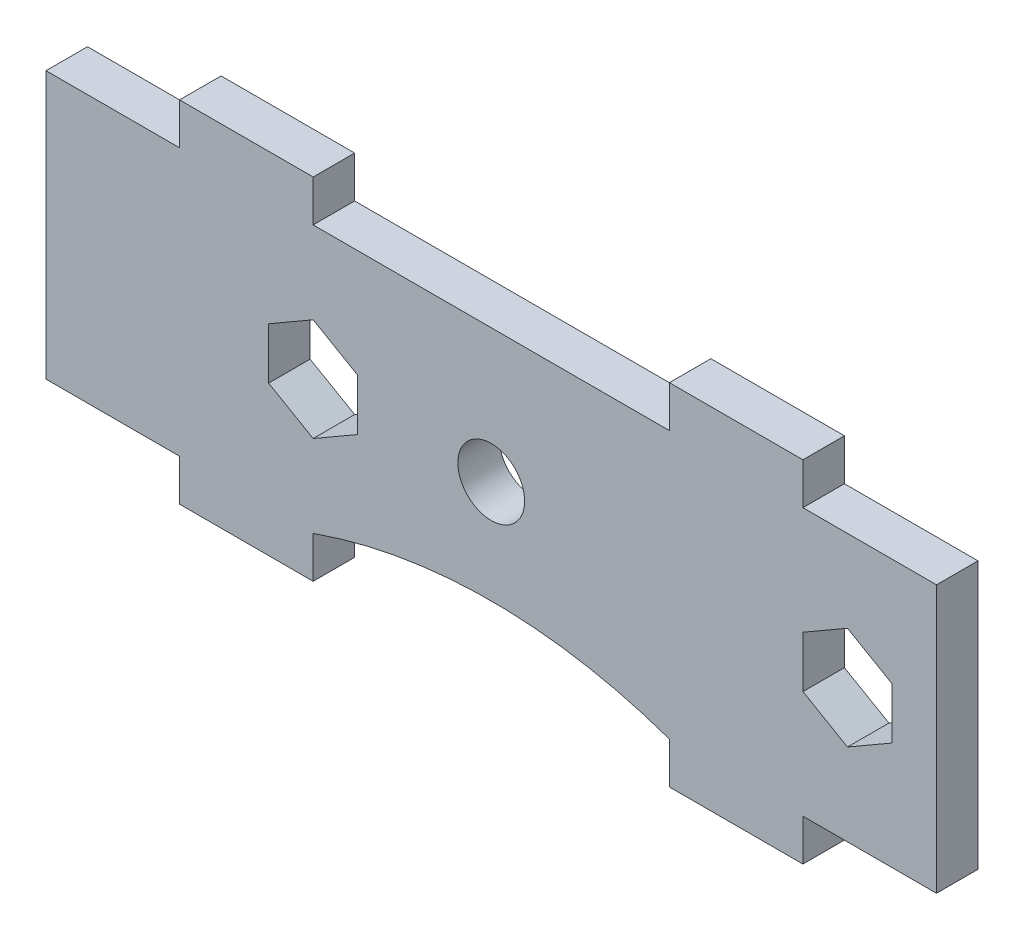
ISO-10303-21;
HEADER;
FILE_DESCRIPTION(('STEP AP214'),'2;1');
FILE_NAME('part.step','',(''),(''),'','','');
FILE_SCHEMA(('AUTOMOTIVE_DESIGN { 1 0 10303 214 1 1 1 1 }'));
ENDSEC;
DATA;
#1=APPLICATION_CONTEXT('core data for automotive mechanical design processes');
#2=APPLICATION_PROTOCOL_DEFINITION('international standard','automotive_design',2000,#1);
#3=PRODUCT_CONTEXT('',#1,'mechanical');
#4=PRODUCT('Part','Part','',(#3));
#5=PRODUCT_RELATED_PRODUCT_CATEGORY('part','',(#4));
#6=PRODUCT_DEFINITION_FORMATION('','',#4);
#7=PRODUCT_DEFINITION_CONTEXT('part definition',#1,'design');
#8=PRODUCT_DEFINITION('design','',#6,#7);
#9=PRODUCT_DEFINITION_SHAPE('','',#8);
#10=(LENGTH_UNIT() NAMED_UNIT(*) SI_UNIT(.MILLI.,.METRE.));
#11=(NAMED_UNIT(*) PLANE_ANGLE_UNIT() SI_UNIT($,.RADIAN.));
#12=(NAMED_UNIT(*) SI_UNIT($,.STERADIAN.) SOLID_ANGLE_UNIT());
#13=UNCERTAINTY_MEASURE_WITH_UNIT(LENGTH_MEASURE(1.E-05),#10,'distance_accuracy_value','');
#14=(GEOMETRIC_REPRESENTATION_CONTEXT(3) GLOBAL_UNCERTAINTY_ASSIGNED_CONTEXT((#13)) GLOBAL_UNIT_ASSIGNED_CONTEXT((#10,
#11,#12)) REPRESENTATION_CONTEXT('',''));
#15=CARTESIAN_POINT('',(0.,0.,0.));
#16=DIRECTION('',(0.,0.,1.));
#17=DIRECTION('',(1.,0.,0.));
#18=AXIS2_PLACEMENT_3D('',#15,#16,#17);
#19=CARTESIAN_POINT('',(0.,0.,1.47955));
#20=DIRECTION('',(0.,0.,1.));
#21=DIRECTION('',(1.,0.,0.));
#22=AXIS2_PLACEMENT_3D('',#19,#20,#21);
#23=PLANE('',#22);
#24=CARTESIAN_POINT('',(0.,-45.4460244842766,1.47955));
#25=DIRECTION('',(0.,0.,1.));
#26=DIRECTION('',(-1.,0.,0.));
#27=AXIS2_PLACEMENT_3D('',#24,#25,#26);
#28=CIRCLE('',#27,38.1);
#29=CARTESIAN_POINT('',(12.7,-9.525,1.47955));
#30=VERTEX_POINT('',#29);
#31=CARTESIAN_POINT('',(-12.7,-9.525,1.47955));
#32=VERTEX_POINT('',#31);
#33=EDGE_CURVE('E247',#30,#32,#28,.T.);
#34=ORIENTED_EDGE('',*,*,#33,.F.);
#35=DIRECTION('',(0.,-1.,0.));
#36=VECTOR('',#35,1.);
#37=CARTESIAN_POINT('',(12.7,-9.525,1.47955));
#38=LINE('',#37,#36);
#39=CARTESIAN_POINT('',(12.7,-12.4841,1.47955));
#40=VERTEX_POINT('',#39);
#41=EDGE_CURVE('E380',#30,#40,#38,.T.);
#42=ORIENTED_EDGE('',*,*,#41,.T.);
#43=DIRECTION('',(1.,0.,0.));
#44=VECTOR('',#43,1.);
#45=CARTESIAN_POINT('',(22.225,-12.4841,1.47955));
#46=LINE('',#45,#44);
#47=CARTESIAN_POINT('',(22.225,-12.4841,1.47955));
#48=VERTEX_POINT('',#47);
#49=EDGE_CURVE('E387',#40,#48,#46,.T.);
#50=ORIENTED_EDGE('',*,*,#49,.T.);
#51=DIRECTION('',(0.,1.,0.));
#52=VECTOR('',#51,1.);
#53=CARTESIAN_POINT('',(22.225,-9.52500000000001,1.47955));
#54=LINE('',#53,#52);
#55=CARTESIAN_POINT('',(22.225,-9.52500000000001,1.47955));
#56=VERTEX_POINT('',#55);
#57=EDGE_CURVE('E389',#48,#56,#54,.T.);
#58=ORIENTED_EDGE('',*,*,#57,.T.);
#59=DIRECTION('',(1.,0.,0.));
#60=VECTOR('',#59,1.);
#61=CARTESIAN_POINT('',(22.225,-9.52500000000001,1.47955));
#62=LINE('',#61,#60);
#63=CARTESIAN_POINT('',(31.75,-9.525,1.47955));
#64=VERTEX_POINT('',#63);
#65=EDGE_CURVE('E391',#56,#64,#62,.T.);
#66=ORIENTED_EDGE('',*,*,#65,.T.);
#67=DIRECTION('',(0.,1.,0.));
#68=VECTOR('',#67,1.);
#69=CARTESIAN_POINT('',(31.75,-9.525,1.47955));
#70=LINE('',#69,#68);
#71=CARTESIAN_POINT('',(31.75,9.525,1.47955));
#72=VERTEX_POINT('',#71);
#73=EDGE_CURVE('E288',#64,#72,#70,.T.);
#74=ORIENTED_EDGE('',*,*,#73,.T.);
#75=DIRECTION('',(-1.,0.,0.));
#76=VECTOR('',#75,1.);
#77=CARTESIAN_POINT('',(22.225,9.52500000000001,1.47955));
#78=LINE('',#77,#76);
#79=CARTESIAN_POINT('',(22.225,9.52500000000001,1.47955));
#80=VERTEX_POINT('',#79);
#81=EDGE_CURVE('E283',#72,#80,#78,.T.);
#82=ORIENTED_EDGE('',*,*,#81,.T.);
#83=DIRECTION('',(0.,1.,0.));
#84=VECTOR('',#83,1.);
#85=CARTESIAN_POINT('',(22.225,9.52500000000001,1.47955));
#86=LINE('',#85,#84);
#87=CARTESIAN_POINT('',(22.225,12.4841,1.47955));
#88=VERTEX_POINT('',#87);
#89=EDGE_CURVE('E410',#80,#88,#86,.T.);
#90=ORIENTED_EDGE('',*,*,#89,.T.);
#91=DIRECTION('',(-1.,0.,0.));
#92=VECTOR('',#91,1.);
#93=CARTESIAN_POINT('',(22.225,12.4841,1.47955));
#94=LINE('',#93,#92);
#95=CARTESIAN_POINT('',(12.7,12.4841,1.47955));
#96=VERTEX_POINT('',#95);
#97=EDGE_CURVE('E339',#88,#96,#94,.T.);
#98=ORIENTED_EDGE('',*,*,#97,.T.);
#99=DIRECTION('',(0.,-1.,0.));
#100=VECTOR('',#99,1.);
#101=CARTESIAN_POINT('',(12.7,9.525,1.47955));
#102=LINE('',#101,#100);
#103=CARTESIAN_POINT('',(12.7,9.525,1.47955));
#104=VERTEX_POINT('',#103);
#105=EDGE_CURVE('E413',#96,#104,#102,.T.);
#106=ORIENTED_EDGE('',*,*,#105,.T.);
#107=DIRECTION('',(-1.,0.,0.));
#108=VECTOR('',#107,1.);
#109=CARTESIAN_POINT('',(-12.7,9.525,1.47955));
#110=LINE('',#109,#108);
#111=CARTESIAN_POINT('',(-12.7,9.525,1.47955));
#112=VERTEX_POINT('',#111);
#113=EDGE_CURVE('E415',#104,#112,#110,.T.);
#114=ORIENTED_EDGE('',*,*,#113,.T.);
#115=DIRECTION('',(0.,1.,0.));
#116=VECTOR('',#115,1.);
#117=CARTESIAN_POINT('',(-12.7,9.525,1.47955));
#118=LINE('',#117,#116);
#119=CARTESIAN_POINT('',(-12.7,12.4841,1.47955));
#120=VERTEX_POINT('',#119);
#121=EDGE_CURVE('E417',#112,#120,#118,.T.);
#122=ORIENTED_EDGE('',*,*,#121,.T.);
#123=DIRECTION('',(-1.,0.,0.));
#124=VECTOR('',#123,1.);
#125=CARTESIAN_POINT('',(-22.225,12.4841,1.47955));
#126=LINE('',#125,#124);
#127=CARTESIAN_POINT('',(-22.225,12.4841,1.47955));
#128=VERTEX_POINT('',#127);
#129=EDGE_CURVE('E419',#120,#128,#126,.T.);
#130=ORIENTED_EDGE('',*,*,#129,.T.);
#131=DIRECTION('',(0.,-1.,0.));
#132=VECTOR('',#131,1.);
#133=CARTESIAN_POINT('',(-22.225,9.525,1.47955));
#134=LINE('',#133,#132);
#135=CARTESIAN_POINT('',(-22.225,9.525,1.47955));
#136=VERTEX_POINT('',#135);
#137=EDGE_CURVE('E421',#128,#136,#134,.T.);
#138=ORIENTED_EDGE('',*,*,#137,.T.);
#139=DIRECTION('',(-1.,0.,0.));
#140=VECTOR('',#139,1.);
#141=CARTESIAN_POINT('',(-31.75,9.525,1.47955));
#142=LINE('',#141,#140);
#143=CARTESIAN_POINT('',(-31.75,9.525,1.47955));
#144=VERTEX_POINT('',#143);
#145=EDGE_CURVE('E423',#136,#144,#142,.T.);
#146=ORIENTED_EDGE('',*,*,#145,.T.);
#147=DIRECTION('',(0.,-1.,0.));
#148=VECTOR('',#147,1.);
#149=CARTESIAN_POINT('',(-31.75,-9.525,1.47955));
#150=LINE('',#149,#148);
#151=CARTESIAN_POINT('',(-31.75,-9.525,1.47955));
#152=VERTEX_POINT('',#151);
#153=EDGE_CURVE('E425',#144,#152,#150,.T.);
#154=ORIENTED_EDGE('',*,*,#153,.T.);
#155=DIRECTION('',(1.,0.,0.));
#156=VECTOR('',#155,1.);
#157=CARTESIAN_POINT('',(-31.75,-9.525,1.47955));
#158=LINE('',#157,#156);
#159=CARTESIAN_POINT('',(-22.225,-9.525,1.47955));
#160=VERTEX_POINT('',#159);
#161=EDGE_CURVE('E382',#152,#160,#158,.T.);
#162=ORIENTED_EDGE('',*,*,#161,.T.);
#163=DIRECTION('',(0.,-1.,0.));
#164=VECTOR('',#163,1.);
#165=CARTESIAN_POINT('',(-22.225,-9.525,1.47955));
#166=LINE('',#165,#164);
#167=CARTESIAN_POINT('',(-22.225,-12.4841,1.47955));
#168=VERTEX_POINT('',#167);
#169=EDGE_CURVE('E378',#160,#168,#166,.T.);
#170=ORIENTED_EDGE('',*,*,#169,.T.);
#171=DIRECTION('',(1.,0.,0.));
#172=VECTOR('',#171,1.);
#173=CARTESIAN_POINT('',(-22.225,-12.4841,1.47955));
#174=LINE('',#173,#172);
#175=CARTESIAN_POINT('',(-12.7,-12.4841,1.47955));
#176=VERTEX_POINT('',#175);
#177=EDGE_CURVE('E375',#168,#176,#174,.T.);
#178=ORIENTED_EDGE('',*,*,#177,.T.);
#179=DIRECTION('',(0.,1.,0.));
#180=VECTOR('',#179,1.);
#181=CARTESIAN_POINT('',(-12.7,-9.525,1.47955));
#182=LINE('',#181,#180);
#183=EDGE_CURVE('E377',#176,#32,#182,.T.);
#184=ORIENTED_EDGE('',*,*,#183,.T.);
#185=EDGE_LOOP('',(#34,#42,#50,#58,#66,#74,#82,#90,#98,#106,#114,#122,#130,#138,#146,#154,#162,
#170,#178,#184));
#186=FACE_BOUND('',#185,.T.);
#187=DIRECTION('',(0.866025403784439,-0.5,0.));
#188=VECTOR('',#187,1.);
#189=CARTESIAN_POINT('',(22.2250000000001,-1.83308710467707,1.47955));
#190=LINE('',#189,#188);
#191=CARTESIAN_POINT('',(22.2250000000001,-1.83308710467707,1.47955));
#192=VERTEX_POINT('',#191);
#193=CARTESIAN_POINT('',(25.4,-3.66617420935413,1.47955));
#194=VERTEX_POINT('',#193);
#195=EDGE_CURVE('E48',#192,#194,#190,.T.);
#196=ORIENTED_EDGE('',*,*,#195,.F.);
#197=DIRECTION('',(0.,-1.,0.));
#198=VECTOR('',#197,1.);
#199=CARTESIAN_POINT('',(22.2250000000001,1.83308710467706,1.47955));
#200=LINE('',#199,#198);
#201=CARTESIAN_POINT('',(22.2250000000001,1.83308710467706,1.47955));
#202=VERTEX_POINT('',#201);
#203=EDGE_CURVE('E516',#202,#192,#200,.T.);
#204=ORIENTED_EDGE('',*,*,#203,.F.);
#205=DIRECTION('',(-0.866025403784433,-0.500000000000009,0.));
#206=VECTOR('',#205,1.);
#207=CARTESIAN_POINT('',(25.4,3.66617420935414,1.47955));
#208=LINE('',#207,#206);
#209=CARTESIAN_POINT('',(25.4,3.66617420935414,1.47955));
#210=VERTEX_POINT('',#209);
#211=EDGE_CURVE('E513',#210,#202,#208,.T.);
#212=ORIENTED_EDGE('',*,*,#211,.F.);
#213=DIRECTION('',(-0.866025403784439,0.499999999999999,0.));
#214=VECTOR('',#213,1.);
#215=CARTESIAN_POINT('',(28.575,1.83308710467707,1.47955));
#216=LINE('',#215,#214);
#217=CARTESIAN_POINT('',(28.575,1.83308710467707,1.47955));
#218=VERTEX_POINT('',#217);
#219=EDGE_CURVE('E510',#218,#210,#216,.T.);
#220=ORIENTED_EDGE('',*,*,#219,.F.);
#221=DIRECTION('',(0.,1.,0.));
#222=VECTOR('',#221,1.);
#223=CARTESIAN_POINT('',(28.5750000000001,-1.83308710467701,1.47955));
#224=LINE('',#223,#222);
#225=CARTESIAN_POINT('',(28.5750000000001,-1.83308710467701,1.47955));
#226=VERTEX_POINT('',#225);
#227=EDGE_CURVE('E507',#226,#218,#224,.T.);
#228=ORIENTED_EDGE('',*,*,#227,.F.);
#229=DIRECTION('',(0.866025403784433,0.500000000000009,0.));
#230=VECTOR('',#229,1.);
#231=CARTESIAN_POINT('',(25.4000000000001,-3.66617420935413,1.47955));
#232=LINE('',#231,#230);
#233=EDGE_CURVE('E504',#194,#226,#232,.T.);
#234=ORIENTED_EDGE('',*,*,#233,.F.);
#235=EDGE_LOOP('',(#196,#204,#212,#220,#228,#234));
#236=FACE_BOUND('',#235,.T.);
#237=DIRECTION('',(0.866025403784438,-0.5,0.));
#238=VECTOR('',#237,1.);
#239=CARTESIAN_POINT('',(-15.875,-1.83308710467706,1.47955));
#240=LINE('',#239,#238);
#241=CARTESIAN_POINT('',(-15.875,-1.83308710467706,1.47955));
#242=VERTEX_POINT('',#241);
#243=CARTESIAN_POINT('',(-12.7,-3.66617420935412,1.47955));
#244=VERTEX_POINT('',#243);
#245=EDGE_CURVE('E548',#242,#244,#240,.T.);
#246=ORIENTED_EDGE('',*,*,#245,.F.);
#247=DIRECTION('',(0.,-1.,0.));
#248=VECTOR('',#247,1.);
#249=CARTESIAN_POINT('',(-15.875,1.83308710467707,1.47955));
#250=LINE('',#249,#248);
#251=CARTESIAN_POINT('',(-15.875,1.83308710467707,1.47955));
#252=VERTEX_POINT('',#251);
#253=EDGE_CURVE('E562',#252,#242,#250,.T.);
#254=ORIENTED_EDGE('',*,*,#253,.F.);
#255=DIRECTION('',(-0.866025403784439,-0.5,0.));
#256=VECTOR('',#255,1.);
#257=CARTESIAN_POINT('',(-12.7,3.66617420935413,1.47955));
#258=LINE('',#257,#256);
#259=CARTESIAN_POINT('',(-12.7,3.66617420935413,1.47955));
#260=VERTEX_POINT('',#259);
#261=EDGE_CURVE('E559',#260,#252,#258,.T.);
#262=ORIENTED_EDGE('',*,*,#261,.F.);
#263=DIRECTION('',(-0.866025403784439,0.5,0.));
#264=VECTOR('',#263,1.);
#265=CARTESIAN_POINT('',(-9.525,1.83308710467706,1.47955));
#266=LINE('',#265,#264);
#267=CARTESIAN_POINT('',(-9.525,1.83308710467706,1.47955));
#268=VERTEX_POINT('',#267);
#269=EDGE_CURVE('E556',#268,#260,#266,.T.);
#270=ORIENTED_EDGE('',*,*,#269,.F.);
#271=DIRECTION('',(0.,1.,0.));
#272=VECTOR('',#271,1.);
#273=CARTESIAN_POINT('',(-9.525,-1.83308710467706,1.47955));
#274=LINE('',#273,#272);
#275=CARTESIAN_POINT('',(-9.525,-1.83308710467706,1.47955));
#276=VERTEX_POINT('',#275);
#277=EDGE_CURVE('E553',#276,#268,#274,.T.);
#278=ORIENTED_EDGE('',*,*,#277,.F.);
#279=DIRECTION('',(0.866025403784439,0.5,0.));
#280=VECTOR('',#279,1.);
#281=CARTESIAN_POINT('',(-12.7,-3.66617420935412,1.47955));
#282=LINE('',#281,#280);
#283=EDGE_CURVE('E550',#244,#276,#282,.T.);
#284=ORIENTED_EDGE('',*,*,#283,.F.);
#285=EDGE_LOOP('',(#246,#254,#262,#270,#278,#284));
#286=FACE_BOUND('',#285,.T.);
#287=CARTESIAN_POINT('',(0.,0.,1.47955));
#288=DIRECTION('',(0.,0.,1.));
#289=DIRECTION('',(1.,0.,0.));
#290=AXIS2_PLACEMENT_3D('',#287,#288,#289);
#291=CIRCLE('',#290,2.38125);
#292=CARTESIAN_POINT('',(2.38125,0.,1.47955));
#293=VERTEX_POINT('',#292);
#294=EDGE_CURVE('E394',#293,#293,#291,.T.);
#295=ORIENTED_EDGE('',*,*,#294,.F.);
#296=EDGE_LOOP('',(#295));
#297=FACE_BOUND('',#296,.T.);
#298=ADVANCED_FACE('F33',(#186,#236,#286,#297),#23,.T.);
#299=CARTESIAN_POINT('',(0.,0.,-1.47955));
#300=DIRECTION('',(0.,0.,1.));
#301=DIRECTION('',(1.,0.,0.));
#302=AXIS2_PLACEMENT_3D('',#299,#300,#301);
#303=PLANE('',#302);
#304=DIRECTION('',(0.,1.,0.));
#305=VECTOR('',#304,1.);
#306=CARTESIAN_POINT('',(22.2250000000001,1.83308710467706,-1.47955));
#307=LINE('',#306,#305);
#308=CARTESIAN_POINT('',(22.2250000000001,-1.83308710467707,-1.47955));
#309=VERTEX_POINT('',#308);
#310=CARTESIAN_POINT('',(22.2250000000001,1.83308710467706,-1.47955));
#311=VERTEX_POINT('',#310);
#312=EDGE_CURVE('E497',#309,#311,#307,.T.);
#313=ORIENTED_EDGE('',*,*,#312,.F.);
#314=DIRECTION('',(-0.866025403784439,0.5,0.));
#315=VECTOR('',#314,1.);
#316=CARTESIAN_POINT('',(22.2250000000001,-1.83308710467707,-1.47955));
#317=LINE('',#316,#315);
#318=CARTESIAN_POINT('',(25.4000000000001,-3.66617420935413,-1.47955));
#319=VERTEX_POINT('',#318);
#320=EDGE_CURVE('E500',#319,#309,#317,.T.);
#321=ORIENTED_EDGE('',*,*,#320,.F.);
#322=DIRECTION('',(-0.866025403784433,-0.500000000000009,0.));
#323=VECTOR('',#322,1.);
#324=CARTESIAN_POINT('',(25.4000000000001,-3.66617420935413,-1.47955));
#325=LINE('',#324,#323);
#326=CARTESIAN_POINT('',(28.5750000000001,-1.83308710467702,-1.47955));
#327=VERTEX_POINT('',#326);
#328=EDGE_CURVE('E522',#327,#319,#325,.T.);
#329=ORIENTED_EDGE('',*,*,#328,.F.);
#330=DIRECTION('',(0.,-1.,0.));
#331=VECTOR('',#330,1.);
#332=CARTESIAN_POINT('',(28.5750000000001,-1.83308710467701,-1.47955));
#333=LINE('',#332,#331);
#334=CARTESIAN_POINT('',(28.575,1.83308710467707,-1.47955));
#335=VERTEX_POINT('',#334);
#336=EDGE_CURVE('E56',#335,#327,#333,.T.);
#337=ORIENTED_EDGE('',*,*,#336,.F.);
#338=DIRECTION('',(0.866025403784439,-0.499999999999999,0.));
#339=VECTOR('',#338,1.);
#340=CARTESIAN_POINT('',(28.575,1.83308710467707,-1.47955));
#341=LINE('',#340,#339);
#342=CARTESIAN_POINT('',(25.4,3.66617420935414,-1.47955));
#343=VERTEX_POINT('',#342);
#344=EDGE_CURVE('E491',#343,#335,#341,.T.);
#345=ORIENTED_EDGE('',*,*,#344,.F.);
#346=DIRECTION('',(0.866025403784433,0.500000000000009,0.));
#347=VECTOR('',#346,1.);
#348=CARTESIAN_POINT('',(25.4,3.66617420935414,-1.47955));
#349=LINE('',#348,#347);
#350=EDGE_CURVE('E494',#311,#343,#349,.T.);
#351=ORIENTED_EDGE('',*,*,#350,.F.);
#352=EDGE_LOOP('',(#313,#321,#329,#337,#345,#351));
#353=FACE_BOUND('',#352,.T.);
#354=DIRECTION('',(0.,1.,0.));
#355=VECTOR('',#354,1.);
#356=CARTESIAN_POINT('',(-15.875,1.83308710467707,-1.47955));
#357=LINE('',#356,#355);
#358=CARTESIAN_POINT('',(-15.875,-1.83308710467706,-1.47955));
#359=VERTEX_POINT('',#358);
#360=CARTESIAN_POINT('',(-15.875,1.83308710467707,-1.47955));
#361=VERTEX_POINT('',#360);
#362=EDGE_CURVE('E542',#359,#361,#357,.T.);
#363=ORIENTED_EDGE('',*,*,#362,.F.);
#364=DIRECTION('',(-0.866025403784439,0.5,0.));
#365=VECTOR('',#364,1.);
#366=CARTESIAN_POINT('',(-15.875,-1.83308710467706,-1.47955));
#367=LINE('',#366,#365);
#368=CARTESIAN_POINT('',(-12.7,-3.66617420935412,-1.47955));
#369=VERTEX_POINT('',#368);
#370=EDGE_CURVE('E545',#369,#359,#367,.T.);
#371=ORIENTED_EDGE('',*,*,#370,.F.);
#372=DIRECTION('',(-0.866025403784439,-0.5,0.));
#373=VECTOR('',#372,1.);
#374=CARTESIAN_POINT('',(-12.7,-3.66617420935412,-1.47955));
#375=LINE('',#374,#373);
#376=CARTESIAN_POINT('',(-9.525,-1.83308710467706,-1.47955));
#377=VERTEX_POINT('',#376);
#378=EDGE_CURVE('E403',#377,#369,#375,.T.);
#379=ORIENTED_EDGE('',*,*,#378,.F.);
#380=DIRECTION('',(0.,-1.,0.));
#381=VECTOR('',#380,1.);
#382=CARTESIAN_POINT('',(-9.525,-1.83308710467706,-1.47955));
#383=LINE('',#382,#381);
#384=CARTESIAN_POINT('',(-9.525,1.83308710467706,-1.47955));
#385=VERTEX_POINT('',#384);
#386=EDGE_CURVE('E534',#385,#377,#383,.T.);
#387=ORIENTED_EDGE('',*,*,#386,.F.);
#388=DIRECTION('',(0.866025403784439,-0.5,0.));
#389=VECTOR('',#388,1.);
#390=CARTESIAN_POINT('',(-9.525,1.83308710467706,-1.47955));
#391=LINE('',#390,#389);
#392=CARTESIAN_POINT('',(-12.7,3.66617420935413,-1.47955));
#393=VERTEX_POINT('',#392);
#394=EDGE_CURVE('E536',#393,#385,#391,.T.);
#395=ORIENTED_EDGE('',*,*,#394,.F.);
#396=DIRECTION('',(0.866025403784439,0.5,0.));
#397=VECTOR('',#396,1.);
#398=CARTESIAN_POINT('',(-12.7,3.66617420935413,-1.47955));
#399=LINE('',#398,#397);
#400=EDGE_CURVE('E539',#361,#393,#399,.T.);
#401=ORIENTED_EDGE('',*,*,#400,.F.);
#402=EDGE_LOOP('',(#363,#371,#379,#387,#395,#401));
#403=FACE_BOUND('',#402,.T.);
#404=DIRECTION('',(0.,-1.,0.));
#405=VECTOR('',#404,1.);
#406=CARTESIAN_POINT('',(12.7,-9.525,-1.47955));
#407=LINE('',#406,#405);
#408=CARTESIAN_POINT('',(12.7,-9.525,-1.47955));
#409=VERTEX_POINT('',#408);
#410=CARTESIAN_POINT('',(12.7,-12.4841,-1.47955));
#411=VERTEX_POINT('',#410);
#412=EDGE_CURVE('E263',#409,#411,#407,.T.);
#413=ORIENTED_EDGE('',*,*,#412,.F.);
#414=CARTESIAN_POINT('',(0.,-45.4460244842766,-1.47955));
#415=DIRECTION('',(0.,0.,1.));
#416=DIRECTION('',(-1.,0.,0.));
#417=AXIS2_PLACEMENT_3D('',#414,#415,#416);
#418=CIRCLE('',#417,38.1);
#419=CARTESIAN_POINT('',(-12.7,-9.525,-1.47955));
#420=VERTEX_POINT('',#419);
#421=EDGE_CURVE('E244',#409,#420,#418,.T.);
#422=ORIENTED_EDGE('',*,*,#421,.T.);
#423=DIRECTION('',(0.,1.,0.));
#424=VECTOR('',#423,1.);
#425=CARTESIAN_POINT('',(-12.7,-9.525,-1.47955));
#426=LINE('',#425,#424);
#427=CARTESIAN_POINT('',(-12.7,-12.4841,-1.47955));
#428=VERTEX_POINT('',#427);
#429=EDGE_CURVE('E261',#428,#420,#426,.T.);
#430=ORIENTED_EDGE('',*,*,#429,.F.);
#431=DIRECTION('',(1.,0.,0.));
#432=VECTOR('',#431,1.);
#433=CARTESIAN_POINT('',(-22.225,-12.4841,-1.47955));
#434=LINE('',#433,#432);
#435=CARTESIAN_POINT('',(-22.225,-12.4841,-1.47955));
#436=VERTEX_POINT('',#435);
#437=EDGE_CURVE('E268',#436,#428,#434,.T.);
#438=ORIENTED_EDGE('',*,*,#437,.F.);
#439=DIRECTION('',(0.,-1.,0.));
#440=VECTOR('',#439,1.);
#441=CARTESIAN_POINT('',(-22.225,-9.525,-1.47955));
#442=LINE('',#441,#440);
#443=CARTESIAN_POINT('',(-22.225,-9.525,-1.47955));
#444=VERTEX_POINT('',#443);
#445=EDGE_CURVE('E272',#444,#436,#442,.T.);
#446=ORIENTED_EDGE('',*,*,#445,.F.);
#447=DIRECTION('',(1.,0.,0.));
#448=VECTOR('',#447,1.);
#449=CARTESIAN_POINT('',(-31.75,-9.525,-1.47955));
#450=LINE('',#449,#448);
#451=CARTESIAN_POINT('',(-31.75,-9.525,-1.47955));
#452=VERTEX_POINT('',#451);
#453=EDGE_CURVE('E364',#452,#444,#450,.T.);
#454=ORIENTED_EDGE('',*,*,#453,.F.);
#455=DIRECTION('',(0.,-1.,0.));
#456=VECTOR('',#455,1.);
#457=CARTESIAN_POINT('',(-31.75,-9.525,-1.47955));
#458=LINE('',#457,#456);
#459=CARTESIAN_POINT('',(-31.75,9.525,-1.47955));
#460=VERTEX_POINT('',#459);
#461=EDGE_CURVE('E362',#460,#452,#458,.T.);
#462=ORIENTED_EDGE('',*,*,#461,.F.);
#463=DIRECTION('',(-1.,0.,0.));
#464=VECTOR('',#463,1.);
#465=CARTESIAN_POINT('',(-31.75,9.525,-1.47955));
#466=LINE('',#465,#464);
#467=CARTESIAN_POINT('',(-22.225,9.525,-1.47955));
#468=VERTEX_POINT('',#467);
#469=EDGE_CURVE('E360',#468,#460,#466,.T.);
#470=ORIENTED_EDGE('',*,*,#469,.F.);
#471=DIRECTION('',(0.,-1.,0.));
#472=VECTOR('',#471,1.);
#473=CARTESIAN_POINT('',(-22.225,9.525,-1.47955));
#474=LINE('',#473,#472);
#475=CARTESIAN_POINT('',(-22.225,12.4841,-1.47955));
#476=VERTEX_POINT('',#475);
#477=EDGE_CURVE('E358',#476,#468,#474,.T.);
#478=ORIENTED_EDGE('',*,*,#477,.F.);
#479=DIRECTION('',(-1.,0.,0.));
#480=VECTOR('',#479,1.);
#481=CARTESIAN_POINT('',(-22.225,12.4841,-1.47955));
#482=LINE('',#481,#480);
#483=CARTESIAN_POINT('',(-12.7,12.4841,-1.47955));
#484=VERTEX_POINT('',#483);
#485=EDGE_CURVE('E356',#484,#476,#482,.T.);
#486=ORIENTED_EDGE('',*,*,#485,.F.);
#487=DIRECTION('',(0.,1.,0.));
#488=VECTOR('',#487,1.);
#489=CARTESIAN_POINT('',(-12.7,9.525,-1.47955));
#490=LINE('',#489,#488);
#491=CARTESIAN_POINT('',(-12.7,9.525,-1.47955));
#492=VERTEX_POINT('',#491);
#493=EDGE_CURVE('E354',#492,#484,#490,.T.);
#494=ORIENTED_EDGE('',*,*,#493,.F.);
#495=DIRECTION('',(-1.,0.,0.));
#496=VECTOR('',#495,1.);
#497=CARTESIAN_POINT('',(-12.7,9.525,-1.47955));
#498=LINE('',#497,#496);
#499=CARTESIAN_POINT('',(12.7,9.525,-1.47955));
#500=VERTEX_POINT('',#499);
#501=EDGE_CURVE('E347',#500,#492,#498,.T.);
#502=ORIENTED_EDGE('',*,*,#501,.F.);
#503=DIRECTION('',(0.,-1.,0.));
#504=VECTOR('',#503,1.);
#505=CARTESIAN_POINT('',(12.7,9.525,-1.47955));
#506=LINE('',#505,#504);
#507=CARTESIAN_POINT('',(12.7,12.4841,-1.47955));
#508=VERTEX_POINT('',#507);
#509=EDGE_CURVE('E345',#508,#500,#506,.T.);
#510=ORIENTED_EDGE('',*,*,#509,.F.);
#511=DIRECTION('',(-1.,0.,0.));
#512=VECTOR('',#511,1.);
#513=CARTESIAN_POINT('',(22.225,12.4841,-1.47955));
#514=LINE('',#513,#512);
#515=CARTESIAN_POINT('',(22.225,12.4841,-1.47955));
#516=VERTEX_POINT('',#515);
#517=EDGE_CURVE('E338',#516,#508,#514,.T.);
#518=ORIENTED_EDGE('',*,*,#517,.F.);
#519=DIRECTION('',(0.,1.,0.));
#520=VECTOR('',#519,1.);
#521=CARTESIAN_POINT('',(22.225,9.52500000000001,-1.47955));
#522=LINE('',#521,#520);
#523=CARTESIAN_POINT('',(22.225,9.52500000000001,-1.47955));
#524=VERTEX_POINT('',#523);
#525=EDGE_CURVE('E343',#524,#516,#522,.T.);
#526=ORIENTED_EDGE('',*,*,#525,.F.);
#527=DIRECTION('',(-1.,0.,0.));
#528=VECTOR('',#527,1.);
#529=CARTESIAN_POINT('',(22.225,9.52500000000001,-1.47955));
#530=LINE('',#529,#528);
#531=CARTESIAN_POINT('',(31.75,9.525,-1.47955));
#532=VERTEX_POINT('',#531);
#533=EDGE_CURVE('E349',#532,#524,#530,.T.);
#534=ORIENTED_EDGE('',*,*,#533,.F.);
#535=DIRECTION('',(0.,1.,0.));
#536=VECTOR('',#535,1.);
#537=CARTESIAN_POINT('',(31.75,-9.525,-1.47955));
#538=LINE('',#537,#536);
#539=CARTESIAN_POINT('',(31.75,-9.525,-1.47955));
#540=VERTEX_POINT('',#539);
#541=EDGE_CURVE('E281',#540,#532,#538,.T.);
#542=ORIENTED_EDGE('',*,*,#541,.F.);
#543=DIRECTION('',(1.,0.,0.));
#544=VECTOR('',#543,1.);
#545=CARTESIAN_POINT('',(22.225,-9.52500000000001,-1.47955));
#546=LINE('',#545,#544);
#547=CARTESIAN_POINT('',(22.225,-9.52500000000001,-1.47955));
#548=VERTEX_POINT('',#547);
#549=EDGE_CURVE('E279',#548,#540,#546,.T.);
#550=ORIENTED_EDGE('',*,*,#549,.F.);
#551=DIRECTION('',(0.,1.,0.));
#552=VECTOR('',#551,1.);
#553=CARTESIAN_POINT('',(22.225,-9.52500000000001,-1.47955));
#554=LINE('',#553,#552);
#555=CARTESIAN_POINT('',(22.225,-12.4841,-1.47955));
#556=VERTEX_POINT('',#555);
#557=EDGE_CURVE('E277',#556,#548,#554,.T.);
#558=ORIENTED_EDGE('',*,*,#557,.F.);
#559=DIRECTION('',(1.,0.,0.));
#560=VECTOR('',#559,1.);
#561=CARTESIAN_POINT('',(22.225,-12.4841,-1.47955));
#562=LINE('',#561,#560);
#563=EDGE_CURVE('E270',#411,#556,#562,.T.);
#564=ORIENTED_EDGE('',*,*,#563,.F.);
#565=EDGE_LOOP('',(#413,#422,#430,#438,#446,#454,#462,#470,#478,#486,#494,#502,#510,#518,#526,
#534,#542,#550,#558,#564));
#566=FACE_BOUND('',#565,.T.);
#567=CARTESIAN_POINT('',(0.,0.,-1.47955));
#568=DIRECTION('',(0.,0.,1.));
#569=DIRECTION('',(1.,0.,0.));
#570=AXIS2_PLACEMENT_3D('',#567,#568,#569);
#571=CIRCLE('',#570,2.38125);
#572=CARTESIAN_POINT('',(2.38125,0.,-1.47955));
#573=VERTEX_POINT('',#572);
#574=EDGE_CURVE('E398',#573,#573,#571,.T.);
#575=ORIENTED_EDGE('',*,*,#574,.T.);
#576=EDGE_LOOP('',(#575));
#577=FACE_BOUND('',#576,.T.);
#578=ADVANCED_FACE('F258',(#353,#403,#566,#577),#303,.F.);
#579=CARTESIAN_POINT('',(22.225,9.52500000000001,1.47955));
#580=DIRECTION('',(0.,-1.,0.));
#581=DIRECTION('',(1.,0.,0.));
#582=AXIS2_PLACEMENT_3D('',#579,#580,#581);
#583=PLANE('',#582);
#584=ORIENTED_EDGE('',*,*,#533,.T.);
#585=DIRECTION('',(0.,0.,-1.));
#586=VECTOR('',#585,1.);
#587=CARTESIAN_POINT('',(22.225,9.52500000000001,1.47955));
#588=LINE('',#587,#586);
#589=EDGE_CURVE('E11',#80,#524,#588,.T.);
#590=ORIENTED_EDGE('',*,*,#589,.F.);
#591=ORIENTED_EDGE('',*,*,#81,.F.);
#592=DIRECTION('',(0.,0.,-1.));
#593=VECTOR('',#592,1.);
#594=CARTESIAN_POINT('',(31.75,9.525,1.47955));
#595=LINE('',#594,#593);
#596=EDGE_CURVE('E284',#72,#532,#595,.T.);
#597=ORIENTED_EDGE('',*,*,#596,.T.);
#598=EDGE_LOOP('',(#584,#590,#591,#597));
#599=FACE_BOUND('',#598,.T.);
#600=ADVANCED_FACE('F35',(#599),#583,.F.);
#601=CARTESIAN_POINT('',(22.225,9.52500000000001,1.47955));
#602=DIRECTION('',(-1.,0.,0.));
#603=DIRECTION('',(0.,-1.,0.));
#604=AXIS2_PLACEMENT_3D('',#601,#602,#603);
#605=PLANE('',#604);
#606=ORIENTED_EDGE('',*,*,#525,.T.);
#607=DIRECTION('',(0.,0.,-1.));
#608=VECTOR('',#607,1.);
#609=CARTESIAN_POINT('',(22.225,12.4841,1.47955));
#610=LINE('',#609,#608);
#611=EDGE_CURVE('E41',#88,#516,#610,.T.);
#612=ORIENTED_EDGE('',*,*,#611,.F.);
#613=ORIENTED_EDGE('',*,*,#89,.F.);
#614=ORIENTED_EDGE('',*,*,#589,.T.);
#615=EDGE_LOOP('',(#606,#612,#613,#614));
#616=FACE_BOUND('',#615,.T.);
#617=ADVANCED_FACE('F464',(#616),#605,.F.);
#618=CARTESIAN_POINT('',(22.225,12.4841,1.47955));
#619=DIRECTION('',(0.,-1.,0.));
#620=DIRECTION('',(1.,0.,0.));
#621=AXIS2_PLACEMENT_3D('',#618,#619,#620);
#622=PLANE('',#621);
#623=ORIENTED_EDGE('',*,*,#517,.T.);
#624=DIRECTION('',(0.,0.,-1.));
#625=VECTOR('',#624,1.);
#626=CARTESIAN_POINT('',(12.7,12.4841,1.47955));
#627=LINE('',#626,#625);
#628=EDGE_CURVE('E329',#96,#508,#627,.T.);
#629=ORIENTED_EDGE('',*,*,#628,.F.);
#630=ORIENTED_EDGE('',*,*,#97,.F.);
#631=ORIENTED_EDGE('',*,*,#611,.T.);
#632=EDGE_LOOP('',(#623,#629,#630,#631));
#633=FACE_BOUND('',#632,.T.);
#634=ADVANCED_FACE('F336',(#633),#622,.F.);
#635=CARTESIAN_POINT('',(12.7,9.525,1.47955));
#636=DIRECTION('',(1.,0.,0.));
#637=DIRECTION('',(0.,1.,0.));
#638=AXIS2_PLACEMENT_3D('',#635,#636,#637);
#639=PLANE('',#638);
#640=ORIENTED_EDGE('',*,*,#509,.T.);
#641=DIRECTION('',(0.,0.,-1.));
#642=VECTOR('',#641,1.);
#643=CARTESIAN_POINT('',(12.7,9.525,1.47955));
#644=LINE('',#643,#642);
#645=EDGE_CURVE('E326',#104,#500,#644,.T.);
#646=ORIENTED_EDGE('',*,*,#645,.F.);
#647=ORIENTED_EDGE('',*,*,#105,.F.);
#648=ORIENTED_EDGE('',*,*,#628,.T.);
#649=EDGE_LOOP('',(#640,#646,#647,#648));
#650=FACE_BOUND('',#649,.T.);
#651=ADVANCED_FACE('F462',(#650),#639,.F.);
#652=CARTESIAN_POINT('',(-12.7,9.525,1.47955));
#653=DIRECTION('',(0.,-1.,0.));
#654=DIRECTION('',(1.,0.,0.));
#655=AXIS2_PLACEMENT_3D('',#652,#653,#654);
#656=PLANE('',#655);
#657=ORIENTED_EDGE('',*,*,#501,.T.);
#658=DIRECTION('',(0.,0.,-1.));
#659=VECTOR('',#658,1.);
#660=CARTESIAN_POINT('',(-12.7,9.525,1.47955));
#661=LINE('',#660,#659);
#662=EDGE_CURVE('E323',#112,#492,#661,.T.);
#663=ORIENTED_EDGE('',*,*,#662,.F.);
#664=ORIENTED_EDGE('',*,*,#113,.F.);
#665=ORIENTED_EDGE('',*,*,#645,.T.);
#666=EDGE_LOOP('',(#657,#663,#664,#665));
#667=FACE_BOUND('',#666,.T.);
#668=ADVANCED_FACE('F458',(#667),#656,.F.);
#669=CARTESIAN_POINT('',(-12.7,9.525,1.47955));
#670=DIRECTION('',(-1.,0.,0.));
#671=DIRECTION('',(0.,-1.,0.));
#672=AXIS2_PLACEMENT_3D('',#669,#670,#671);
#673=PLANE('',#672);
#674=ORIENTED_EDGE('',*,*,#493,.T.);
#675=DIRECTION('',(0.,0.,-1.));
#676=VECTOR('',#675,1.);
#677=CARTESIAN_POINT('',(-12.7,12.4841,1.47955));
#678=LINE('',#677,#676);
#679=EDGE_CURVE('E320',#120,#484,#678,.T.);
#680=ORIENTED_EDGE('',*,*,#679,.F.);
#681=ORIENTED_EDGE('',*,*,#121,.F.);
#682=ORIENTED_EDGE('',*,*,#662,.T.);
#683=EDGE_LOOP('',(#674,#680,#681,#682));
#684=FACE_BOUND('',#683,.T.);
#685=ADVANCED_FACE('F454',(#684),#673,.F.);
#686=CARTESIAN_POINT('',(-22.225,12.4841,1.47955));
#687=DIRECTION('',(0.,-1.,0.));
#688=DIRECTION('',(0.,0.,-1.));
#689=AXIS2_PLACEMENT_3D('',#686,#687,#688);
#690=PLANE('',#689);
#691=ORIENTED_EDGE('',*,*,#485,.T.);
#692=DIRECTION('',(0.,0.,-1.));
#693=VECTOR('',#692,1.);
#694=CARTESIAN_POINT('',(-22.225,12.4841,1.47955));
#695=LINE('',#694,#693);
#696=EDGE_CURVE('E317',#128,#476,#695,.T.);
#697=ORIENTED_EDGE('',*,*,#696,.F.);
#698=ORIENTED_EDGE('',*,*,#129,.F.);
#699=ORIENTED_EDGE('',*,*,#679,.T.);
#700=EDGE_LOOP('',(#691,#697,#698,#699));
#701=FACE_BOUND('',#700,.T.);
#702=ADVANCED_FACE('F449',(#701),#690,.F.);
#703=CARTESIAN_POINT('',(-22.225,9.525,1.47955));
#704=DIRECTION('',(1.,0.,0.));
#705=DIRECTION('',(0.,0.,-1.));
#706=AXIS2_PLACEMENT_3D('',#703,#704,#705);
#707=PLANE('',#706);
#708=ORIENTED_EDGE('',*,*,#477,.T.);
#709=DIRECTION('',(0.,0.,-1.));
#710=VECTOR('',#709,1.);
#711=CARTESIAN_POINT('',(-22.225,9.525,1.47955));
#712=LINE('',#711,#710);
#713=EDGE_CURVE('E314',#136,#468,#712,.T.);
#714=ORIENTED_EDGE('',*,*,#713,.F.);
#715=ORIENTED_EDGE('',*,*,#137,.F.);
#716=ORIENTED_EDGE('',*,*,#696,.T.);
#717=EDGE_LOOP('',(#708,#714,#715,#716));
#718=FACE_BOUND('',#717,.T.);
#719=ADVANCED_FACE('F444',(#718),#707,.F.);
#720=CARTESIAN_POINT('',(-31.75,9.525,1.47955));
#721=DIRECTION('',(0.,-1.,0.));
#722=DIRECTION('',(0.,0.,-1.));
#723=AXIS2_PLACEMENT_3D('',#720,#721,#722);
#724=PLANE('',#723);
#725=ORIENTED_EDGE('',*,*,#469,.T.);
#726=DIRECTION('',(0.,0.,-1.));
#727=VECTOR('',#726,1.);
#728=CARTESIAN_POINT('',(-31.75,9.525,1.47955));
#729=LINE('',#728,#727);
#730=EDGE_CURVE('E311',#144,#460,#729,.T.);
#731=ORIENTED_EDGE('',*,*,#730,.F.);
#732=ORIENTED_EDGE('',*,*,#145,.F.);
#733=ORIENTED_EDGE('',*,*,#713,.T.);
#734=EDGE_LOOP('',(#725,#731,#732,#733));
#735=FACE_BOUND('',#734,.T.);
#736=ADVANCED_FACE('F440',(#735),#724,.F.);
#737=CARTESIAN_POINT('',(-31.75,-9.525,1.47955));
#738=DIRECTION('',(1.,0.,0.));
#739=DIRECTION('',(0.,0.,-1.));
#740=AXIS2_PLACEMENT_3D('',#737,#738,#739);
#741=PLANE('',#740);
#742=ORIENTED_EDGE('',*,*,#461,.T.);
#743=DIRECTION('',(0.,0.,-1.));
#744=VECTOR('',#743,1.);
#745=CARTESIAN_POINT('',(-31.75,-9.525,1.47955));
#746=LINE('',#745,#744);
#747=EDGE_CURVE('E308',#152,#452,#746,.T.);
#748=ORIENTED_EDGE('',*,*,#747,.F.);
#749=ORIENTED_EDGE('',*,*,#153,.F.);
#750=ORIENTED_EDGE('',*,*,#730,.T.);
#751=EDGE_LOOP('',(#742,#748,#749,#750));
#752=FACE_BOUND('',#751,.T.);
#753=ADVANCED_FACE('F436',(#752),#741,.F.);
#754=CARTESIAN_POINT('',(-31.75,-9.525,1.47955));
#755=DIRECTION('',(0.,1.,0.));
#756=DIRECTION('',(0.,0.,1.));
#757=AXIS2_PLACEMENT_3D('',#754,#755,#756);
#758=PLANE('',#757);
#759=ORIENTED_EDGE('',*,*,#453,.T.);
#760=DIRECTION('',(0.,0.,-1.));
#761=VECTOR('',#760,1.);
#762=CARTESIAN_POINT('',(-22.225,-9.525,1.47955));
#763=LINE('',#762,#761);
#764=EDGE_CURVE('E305',#160,#444,#763,.T.);
#765=ORIENTED_EDGE('',*,*,#764,.F.);
#766=ORIENTED_EDGE('',*,*,#161,.F.);
#767=ORIENTED_EDGE('',*,*,#747,.T.);
#768=EDGE_LOOP('',(#759,#765,#766,#767));
#769=FACE_BOUND('',#768,.T.);
#770=ADVANCED_FACE('F431',(#769),#758,.F.);
#771=CARTESIAN_POINT('',(-22.225,-9.525,1.47955));
#772=DIRECTION('',(1.,0.,0.));
#773=DIRECTION('',(0.,0.,-1.));
#774=AXIS2_PLACEMENT_3D('',#771,#772,#773);
#775=PLANE('',#774);
#776=ORIENTED_EDGE('',*,*,#445,.T.);
#777=DIRECTION('',(0.,0.,-1.));
#778=VECTOR('',#777,1.);
#779=CARTESIAN_POINT('',(-22.225,-12.4841,1.47955));
#780=LINE('',#779,#778);
#781=EDGE_CURVE('E302',#168,#436,#780,.T.);
#782=ORIENTED_EDGE('',*,*,#781,.F.);
#783=ORIENTED_EDGE('',*,*,#169,.F.);
#784=ORIENTED_EDGE('',*,*,#764,.T.);
#785=EDGE_LOOP('',(#776,#782,#783,#784));
#786=FACE_BOUND('',#785,.T.);
#787=ADVANCED_FACE('F368',(#786),#775,.F.);
#788=CARTESIAN_POINT('',(-22.225,-12.4841,1.47955));
#789=DIRECTION('',(0.,1.,0.));
#790=DIRECTION('',(0.,0.,1.));
#791=AXIS2_PLACEMENT_3D('',#788,#789,#790);
#792=PLANE('',#791);
#793=ORIENTED_EDGE('',*,*,#437,.T.);
#794=DIRECTION('',(0.,0.,-1.));
#795=VECTOR('',#794,1.);
#796=CARTESIAN_POINT('',(-12.7,-12.4841,1.47955));
#797=LINE('',#796,#795);
#798=EDGE_CURVE('E252',#176,#428,#797,.T.);
#799=ORIENTED_EDGE('',*,*,#798,.F.);
#800=ORIENTED_EDGE('',*,*,#177,.F.);
#801=ORIENTED_EDGE('',*,*,#781,.T.);
#802=EDGE_LOOP('',(#793,#799,#800,#801));
#803=FACE_BOUND('',#802,.T.);
#804=ADVANCED_FACE('F374',(#803),#792,.F.);
#805=CARTESIAN_POINT('',(-12.7,-9.525,1.47955));
#806=DIRECTION('',(-1.,0.,0.));
#807=DIRECTION('',(0.,-1.,0.));
#808=AXIS2_PLACEMENT_3D('',#805,#806,#807);
#809=PLANE('',#808);
#810=ORIENTED_EDGE('',*,*,#429,.T.);
#811=DIRECTION('',(0.,0.,-1.));
#812=VECTOR('',#811,1.);
#813=CARTESIAN_POINT('',(-12.7,-9.525,1.47955));
#814=LINE('',#813,#812);
#815=EDGE_CURVE('E241',#32,#420,#814,.T.);
#816=ORIENTED_EDGE('',*,*,#815,.F.);
#817=ORIENTED_EDGE('',*,*,#183,.F.);
#818=ORIENTED_EDGE('',*,*,#798,.T.);
#819=EDGE_LOOP('',(#810,#816,#817,#818));
#820=FACE_BOUND('',#819,.T.);
#821=ADVANCED_FACE('F266',(#820),#809,.F.);
#822=CARTESIAN_POINT('',(12.7,-9.525,1.47955));
#823=DIRECTION('',(1.,0.,0.));
#824=DIRECTION('',(0.,1.,0.));
#825=AXIS2_PLACEMENT_3D('',#822,#823,#824);
#826=PLANE('',#825);
#827=ORIENTED_EDGE('',*,*,#412,.T.);
#828=DIRECTION('',(0.,0.,-1.));
#829=VECTOR('',#828,1.);
#830=CARTESIAN_POINT('',(12.7,-12.4841,1.47955));
#831=LINE('',#830,#829);
#832=EDGE_CURVE('E297',#40,#411,#831,.T.);
#833=ORIENTED_EDGE('',*,*,#832,.F.);
#834=ORIENTED_EDGE('',*,*,#41,.F.);
#835=DIRECTION('',(0.,0.,-1.));
#836=VECTOR('',#835,1.);
#837=CARTESIAN_POINT('',(12.7,-9.525,1.47955));
#838=LINE('',#837,#836);
#839=EDGE_CURVE('E253',#30,#409,#838,.T.);
#840=ORIENTED_EDGE('',*,*,#839,.T.);
#841=EDGE_LOOP('',(#827,#833,#834,#840));
#842=FACE_BOUND('',#841,.T.);
#843=ADVANCED_FACE('F487',(#842),#826,.F.);
#844=CARTESIAN_POINT('',(22.225,-12.4841,1.47955));
#845=DIRECTION('',(0.,1.,0.));
#846=DIRECTION('',(-1.,0.,0.));
#847=AXIS2_PLACEMENT_3D('',#844,#845,#846);
#848=PLANE('',#847);
#849=ORIENTED_EDGE('',*,*,#563,.T.);
#850=DIRECTION('',(0.,0.,-1.));
#851=VECTOR('',#850,1.);
#852=CARTESIAN_POINT('',(22.225,-12.4841,1.47955));
#853=LINE('',#852,#851);
#854=EDGE_CURVE('E294',#48,#556,#853,.T.);
#855=ORIENTED_EDGE('',*,*,#854,.F.);
#856=ORIENTED_EDGE('',*,*,#49,.F.);
#857=ORIENTED_EDGE('',*,*,#832,.T.);
#858=EDGE_LOOP('',(#849,#855,#856,#857));
#859=FACE_BOUND('',#858,.T.);
#860=ADVANCED_FACE('F482',(#859),#848,.F.);
#861=CARTESIAN_POINT('',(22.225,-9.52500000000001,1.47955));
#862=DIRECTION('',(-1.,0.,0.));
#863=DIRECTION('',(0.,-1.,0.));
#864=AXIS2_PLACEMENT_3D('',#861,#862,#863);
#865=PLANE('',#864);
#866=ORIENTED_EDGE('',*,*,#557,.T.);
#867=DIRECTION('',(0.,0.,-1.));
#868=VECTOR('',#867,1.);
#869=CARTESIAN_POINT('',(22.225,-9.52500000000001,1.47955));
#870=LINE('',#869,#868);
#871=EDGE_CURVE('E291',#56,#548,#870,.T.);
#872=ORIENTED_EDGE('',*,*,#871,.F.);
#873=ORIENTED_EDGE('',*,*,#57,.F.);
#874=ORIENTED_EDGE('',*,*,#854,.T.);
#875=EDGE_LOOP('',(#866,#872,#873,#874));
#876=FACE_BOUND('',#875,.T.);
#877=ADVANCED_FACE('F479',(#876),#865,.F.);
#878=CARTESIAN_POINT('',(22.225,-9.52500000000001,1.47955));
#879=DIRECTION('',(0.,1.,0.));
#880=DIRECTION('',(-1.,0.,0.));
#881=AXIS2_PLACEMENT_3D('',#878,#879,#880);
#882=PLANE('',#881);
#883=ORIENTED_EDGE('',*,*,#549,.T.);
#884=DIRECTION('',(0.,0.,-1.));
#885=VECTOR('',#884,1.);
#886=CARTESIAN_POINT('',(31.75,-9.525,1.47955));
#887=LINE('',#886,#885);
#888=EDGE_CURVE('E287',#64,#540,#887,.T.);
#889=ORIENTED_EDGE('',*,*,#888,.F.);
#890=ORIENTED_EDGE('',*,*,#65,.F.);
#891=ORIENTED_EDGE('',*,*,#871,.T.);
#892=EDGE_LOOP('',(#883,#889,#890,#891));
#893=FACE_BOUND('',#892,.T.);
#894=ADVANCED_FACE('F475',(#893),#882,.F.);
#895=CARTESIAN_POINT('',(31.75,-9.525,1.47955));
#896=DIRECTION('',(-1.,0.,0.));
#897=DIRECTION('',(0.,0.,1.));
#898=AXIS2_PLACEMENT_3D('',#895,#896,#897);
#899=PLANE('',#898);
#900=ORIENTED_EDGE('',*,*,#541,.T.);
#901=ORIENTED_EDGE('',*,*,#596,.F.);
#902=ORIENTED_EDGE('',*,*,#73,.F.);
#903=ORIENTED_EDGE('',*,*,#888,.T.);
#904=EDGE_LOOP('',(#900,#901,#902,#903));
#905=FACE_BOUND('',#904,.T.);
#906=ADVANCED_FACE('F471',(#905),#899,.F.);
#907=CARTESIAN_POINT('',(0.,0.,1.47955));
#908=DIRECTION('',(0.,0.,-1.));
#909=DIRECTION('',(-1.,0.,0.));
#910=AXIS2_PLACEMENT_3D('',#907,#908,#909);
#911=CYLINDRICAL_SURFACE('',#910,2.38125);
#912=ORIENTED_EDGE('',*,*,#294,.T.);
#913=EDGE_LOOP('',(#912));
#914=FACE_BOUND('',#913,.T.);
#915=ORIENTED_EDGE('',*,*,#574,.F.);
#916=EDGE_LOOP('',(#915));
#917=FACE_BOUND('',#916,.T.);
#918=ADVANCED_FACE('F622',(#914,#917),#911,.F.);
#919=CARTESIAN_POINT('',(-15.875,-1.83308710467706,-1.48055));
#920=DIRECTION('',(-0.5,-0.866025403784439,0.));
#921=DIRECTION('',(0.866025403784439,-0.5,0.));
#922=AXIS2_PLACEMENT_3D('',#919,#920,#921);
#923=PLANE('',#922);
#924=ORIENTED_EDGE('',*,*,#370,.T.);
#925=DIRECTION('',(0.,0.,1.));
#926=VECTOR('',#925,1.);
#927=CARTESIAN_POINT('',(-15.875,-1.83308710467706,-1.48055));
#928=LINE('',#927,#926);
#929=EDGE_CURVE('E566',#359,#242,#928,.T.);
#930=ORIENTED_EDGE('',*,*,#929,.T.);
#931=ORIENTED_EDGE('',*,*,#245,.T.);
#932=DIRECTION('',(0.,0.,1.));
#933=VECTOR('',#932,1.);
#934=CARTESIAN_POINT('',(-12.7,-3.66617420935412,-1.48055));
#935=LINE('',#934,#933);
#936=EDGE_CURVE('E565',#369,#244,#935,.T.);
#937=ORIENTED_EDGE('',*,*,#936,.F.);
#938=EDGE_LOOP('',(#924,#930,#931,#937));
#939=FACE_BOUND('',#938,.T.);
#940=ADVANCED_FACE('F598',(#939),#923,.F.);
#941=CARTESIAN_POINT('',(-15.875,1.83308710467707,-1.48055));
#942=DIRECTION('',(-1.,0.,0.));
#943=DIRECTION('',(0.,0.,1.));
#944=AXIS2_PLACEMENT_3D('',#941,#942,#943);
#945=PLANE('',#944);
#946=ORIENTED_EDGE('',*,*,#362,.T.);
#947=DIRECTION('',(0.,0.,1.));
#948=VECTOR('',#947,1.);
#949=CARTESIAN_POINT('',(-15.875,1.83308710467707,-1.48055));
#950=LINE('',#949,#948);
#951=EDGE_CURVE('E568',#361,#252,#950,.T.);
#952=ORIENTED_EDGE('',*,*,#951,.T.);
#953=ORIENTED_EDGE('',*,*,#253,.T.);
#954=ORIENTED_EDGE('',*,*,#929,.F.);
#955=EDGE_LOOP('',(#946,#952,#953,#954));
#956=FACE_BOUND('',#955,.T.);
#957=ADVANCED_FACE('F600',(#956),#945,.F.);
#958=CARTESIAN_POINT('',(-12.7,3.66617420935413,-1.48055));
#959=DIRECTION('',(-0.5,0.866025403784439,0.));
#960=DIRECTION('',(-0.866025403784439,-0.5,0.));
#961=AXIS2_PLACEMENT_3D('',#958,#959,#960);
#962=PLANE('',#961);
#963=ORIENTED_EDGE('',*,*,#400,.T.);
#964=DIRECTION('',(0.,0.,1.));
#965=VECTOR('',#964,1.);
#966=CARTESIAN_POINT('',(-12.7,3.66617420935413,-1.48055));
#967=LINE('',#966,#965);
#968=EDGE_CURVE('E570',#393,#260,#967,.T.);
#969=ORIENTED_EDGE('',*,*,#968,.T.);
#970=ORIENTED_EDGE('',*,*,#261,.T.);
#971=ORIENTED_EDGE('',*,*,#951,.F.);
#972=EDGE_LOOP('',(#963,#969,#970,#971));
#973=FACE_BOUND('',#972,.T.);
#974=ADVANCED_FACE('F602',(#973),#962,.F.);
#975=CARTESIAN_POINT('',(-9.525,1.83308710467706,-1.48055));
#976=DIRECTION('',(0.5,0.866025403784439,0.));
#977=DIRECTION('',(-0.866025403784439,0.5,0.));
#978=AXIS2_PLACEMENT_3D('',#975,#976,#977);
#979=PLANE('',#978);
#980=ORIENTED_EDGE('',*,*,#394,.T.);
#981=DIRECTION('',(0.,0.,1.));
#982=VECTOR('',#981,1.);
#983=CARTESIAN_POINT('',(-9.525,1.83308710467706,-1.48055));
#984=LINE('',#983,#982);
#985=EDGE_CURVE('E572',#385,#268,#984,.T.);
#986=ORIENTED_EDGE('',*,*,#985,.T.);
#987=ORIENTED_EDGE('',*,*,#269,.T.);
#988=ORIENTED_EDGE('',*,*,#968,.F.);
#989=EDGE_LOOP('',(#980,#986,#987,#988));
#990=FACE_BOUND('',#989,.T.);
#991=ADVANCED_FACE('F604',(#990),#979,.F.);
#992=CARTESIAN_POINT('',(-9.525,-1.83308710467706,-1.48055));
#993=DIRECTION('',(1.,0.,0.));
#994=DIRECTION('',(0.,0.,-1.));
#995=AXIS2_PLACEMENT_3D('',#992,#993,#994);
#996=PLANE('',#995);
#997=ORIENTED_EDGE('',*,*,#386,.T.);
#998=DIRECTION('',(0.,0.,1.));
#999=VECTOR('',#998,1.);
#1000=CARTESIAN_POINT('',(-9.525,-1.83308710467706,-1.48055));
#1001=LINE('',#1000,#999);
#1002=EDGE_CURVE('E574',#377,#276,#1001,.T.);
#1003=ORIENTED_EDGE('',*,*,#1002,.T.);
#1004=ORIENTED_EDGE('',*,*,#277,.T.);
#1005=ORIENTED_EDGE('',*,*,#985,.F.);
#1006=EDGE_LOOP('',(#997,#1003,#1004,#1005));
#1007=FACE_BOUND('',#1006,.T.);
#1008=ADVANCED_FACE('F592',(#1007),#996,.F.);
#1009=CARTESIAN_POINT('',(-12.7,-3.66617420935412,-1.48055));
#1010=DIRECTION('',(0.5,-0.866025403784439,0.));
#1011=DIRECTION('',(0.866025403784439,0.5,0.));
#1012=AXIS2_PLACEMENT_3D('',#1009,#1010,#1011);
#1013=PLANE('',#1012);
#1014=ORIENTED_EDGE('',*,*,#378,.T.);
#1015=ORIENTED_EDGE('',*,*,#936,.T.);
#1016=ORIENTED_EDGE('',*,*,#283,.T.);
#1017=ORIENTED_EDGE('',*,*,#1002,.F.);
#1018=EDGE_LOOP('',(#1014,#1015,#1016,#1017));
#1019=FACE_BOUND('',#1018,.T.);
#1020=ADVANCED_FACE('F579',(#1019),#1013,.F.);
#1021=CARTESIAN_POINT('',(22.2250000000001,-1.83308710467707,-1.48055));
#1022=DIRECTION('',(-0.5,-0.866025403784439,0.));
#1023=DIRECTION('',(0.866025403784439,-0.5,0.));
#1024=AXIS2_PLACEMENT_3D('',#1021,#1022,#1023);
#1025=PLANE('',#1024);
#1026=ORIENTED_EDGE('',*,*,#320,.T.);
#1027=DIRECTION('',(0.,0.,1.));
#1028=VECTOR('',#1027,1.);
#1029=CARTESIAN_POINT('',(22.2250000000001,-1.83308710467707,-1.48055));
#1030=LINE('',#1029,#1028);
#1031=EDGE_CURVE('E520',#309,#192,#1030,.T.);
#1032=ORIENTED_EDGE('',*,*,#1031,.T.);
#1033=ORIENTED_EDGE('',*,*,#195,.T.);
#1034=DIRECTION('',(0.,0.,1.));
#1035=VECTOR('',#1034,1.);
#1036=CARTESIAN_POINT('',(25.4000000000001,-3.66617420935413,-1.48055));
#1037=LINE('',#1036,#1035);
#1038=EDGE_CURVE('E519',#319,#194,#1037,.T.);
#1039=ORIENTED_EDGE('',*,*,#1038,.F.);
#1040=EDGE_LOOP('',(#1026,#1032,#1033,#1039));
#1041=FACE_BOUND('',#1040,.T.);
#1042=ADVANCED_FACE('F727',(#1041),#1025,.F.);
#1043=CARTESIAN_POINT('',(22.2250000000001,1.83308710467706,-1.48055));
#1044=DIRECTION('',(-1.,0.,0.));
#1045=DIRECTION('',(0.,-1.,0.));
#1046=AXIS2_PLACEMENT_3D('',#1043,#1044,#1045);
#1047=PLANE('',#1046);
#1048=ORIENTED_EDGE('',*,*,#312,.T.);
#1049=DIRECTION('',(0.,0.,1.));
#1050=VECTOR('',#1049,1.);
#1051=CARTESIAN_POINT('',(22.2250000000001,1.83308710467706,-1.48055));
#1052=LINE('',#1051,#1050);
#1053=EDGE_CURVE('E523',#311,#202,#1052,.T.);
#1054=ORIENTED_EDGE('',*,*,#1053,.T.);
#1055=ORIENTED_EDGE('',*,*,#203,.T.);
#1056=ORIENTED_EDGE('',*,*,#1031,.F.);
#1057=EDGE_LOOP('',(#1048,#1054,#1055,#1056));
#1058=FACE_BOUND('',#1057,.T.);
#1059=ADVANCED_FACE('F719',(#1058),#1047,.F.);
#1060=CARTESIAN_POINT('',(25.4,3.66617420935414,-1.48055));
#1061=DIRECTION('',(-0.500000000000009,0.866025403784433,0.));
#1062=DIRECTION('',(-0.866025403784433,-0.500000000000009,0.));
#1063=AXIS2_PLACEMENT_3D('',#1060,#1061,#1062);
#1064=PLANE('',#1063);
#1065=ORIENTED_EDGE('',*,*,#350,.T.);
#1066=DIRECTION('',(0.,0.,1.));
#1067=VECTOR('',#1066,1.);
#1068=CARTESIAN_POINT('',(25.4,3.66617420935414,-1.48055));
#1069=LINE('',#1068,#1067);
#1070=EDGE_CURVE('E525',#343,#210,#1069,.T.);
#1071=ORIENTED_EDGE('',*,*,#1070,.T.);
#1072=ORIENTED_EDGE('',*,*,#211,.T.);
#1073=ORIENTED_EDGE('',*,*,#1053,.F.);
#1074=EDGE_LOOP('',(#1065,#1071,#1072,#1073));
#1075=FACE_BOUND('',#1074,.T.);
#1076=ADVANCED_FACE('F711',(#1075),#1064,.F.);
#1077=CARTESIAN_POINT('',(28.575,1.83308710467707,-1.48055));
#1078=DIRECTION('',(0.499999999999999,0.866025403784439,0.));
#1079=DIRECTION('',(-0.866025403784439,0.499999999999999,0.));
#1080=AXIS2_PLACEMENT_3D('',#1077,#1078,#1079);
#1081=PLANE('',#1080);
#1082=ORIENTED_EDGE('',*,*,#344,.T.);
#1083=DIRECTION('',(0.,0.,1.));
#1084=VECTOR('',#1083,1.);
#1085=CARTESIAN_POINT('',(28.575,1.83308710467707,-1.48055));
#1086=LINE('',#1085,#1084);
#1087=EDGE_CURVE('E527',#335,#218,#1086,.T.);
#1088=ORIENTED_EDGE('',*,*,#1087,.T.);
#1089=ORIENTED_EDGE('',*,*,#219,.T.);
#1090=ORIENTED_EDGE('',*,*,#1070,.F.);
#1091=EDGE_LOOP('',(#1082,#1088,#1089,#1090));
#1092=FACE_BOUND('',#1091,.T.);
#1093=ADVANCED_FACE('F704',(#1092),#1081,.F.);
#1094=CARTESIAN_POINT('',(28.5750000000001,-1.83308710467701,-1.48055));
#1095=DIRECTION('',(1.,0.,0.));
#1096=DIRECTION('',(0.,1.,0.));
#1097=AXIS2_PLACEMENT_3D('',#1094,#1095,#1096);
#1098=PLANE('',#1097);
#1099=ORIENTED_EDGE('',*,*,#336,.T.);
#1100=DIRECTION('',(0.,0.,1.));
#1101=VECTOR('',#1100,1.);
#1102=CARTESIAN_POINT('',(28.5750000000001,-1.83308710467701,-1.48055));
#1103=LINE('',#1102,#1101);
#1104=EDGE_CURVE('E529',#327,#226,#1103,.T.);
#1105=ORIENTED_EDGE('',*,*,#1104,.T.);
#1106=ORIENTED_EDGE('',*,*,#227,.T.);
#1107=ORIENTED_EDGE('',*,*,#1087,.F.);
#1108=EDGE_LOOP('',(#1099,#1105,#1106,#1107));
#1109=FACE_BOUND('',#1108,.T.);
#1110=ADVANCED_FACE('F697',(#1109),#1098,.F.);
#1111=CARTESIAN_POINT('',(25.4000000000001,-3.66617420935413,-1.48055));
#1112=DIRECTION('',(0.500000000000009,-0.866025403784433,0.));
#1113=DIRECTION('',(0.866025403784433,0.500000000000009,0.));
#1114=AXIS2_PLACEMENT_3D('',#1111,#1112,#1113);
#1115=PLANE('',#1114);
#1116=ORIENTED_EDGE('',*,*,#328,.T.);
#1117=ORIENTED_EDGE('',*,*,#1038,.T.);
#1118=ORIENTED_EDGE('',*,*,#233,.T.);
#1119=ORIENTED_EDGE('',*,*,#1104,.F.);
#1120=EDGE_LOOP('',(#1116,#1117,#1118,#1119));
#1121=FACE_BOUND('',#1120,.T.);
#1122=ADVANCED_FACE('F688',(#1121),#1115,.F.);
#1123=CARTESIAN_POINT('',(0.,-45.4460244842766,-1.47955));
#1124=DIRECTION('',(0.,0.,1.));
#1125=DIRECTION('',(1.,0.,0.));
#1126=AXIS2_PLACEMENT_3D('',#1123,#1124,#1125);
#1127=CYLINDRICAL_SURFACE('',#1126,38.1);
#1128=ORIENTED_EDGE('',*,*,#33,.T.);
#1129=ORIENTED_EDGE('',*,*,#815,.T.);
#1130=ORIENTED_EDGE('',*,*,#421,.F.);
#1131=ORIENTED_EDGE('',*,*,#839,.F.);
#1132=EDGE_LOOP('',(#1128,#1129,#1130,#1131));
#1133=FACE_BOUND('',#1132,.T.);
#1134=ADVANCED_FACE('F243',(#1133),#1127,.F.);
#1135=CLOSED_SHELL('',(#298,#578,#600,#617,#634,#651,#668,#685,#702,#719,#736,#753,#770,#787,
#804,#821,#843,#860,#877,#894,#906,#918,#940,#957,#974,#991,#1008,#1020,#1042,#1059,#1076,#1093,
#1110,#1122,#1134));
#1136=MANIFOLD_SOLID_BREP('B2',#1135);
#1137=ADVANCED_BREP_SHAPE_REPRESENTATION('',(#18,#1136),#14);
#1138=SHAPE_DEFINITION_REPRESENTATION(#9,#1137);
ENDSEC;
END-ISO-10303-21;
